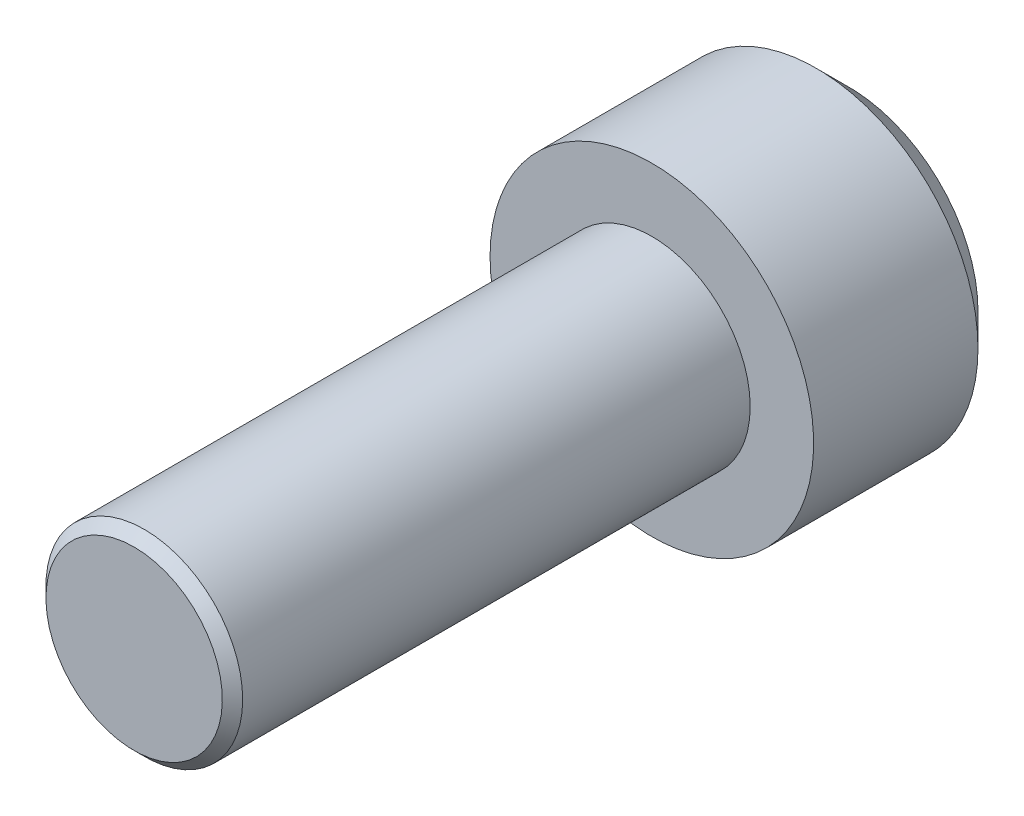
ISO-10303-21;
HEADER;
FILE_DESCRIPTION(('STEP AP214'),'2;1');
FILE_NAME('part.step','',(''),(''),'','','');
FILE_SCHEMA(('AUTOMOTIVE_DESIGN { 1 0 10303 214 1 1 1 1 }'));
ENDSEC;
DATA;
#1=APPLICATION_CONTEXT('core data for automotive mechanical design processes');
#2=APPLICATION_PROTOCOL_DEFINITION('international standard','automotive_design',2000,#1);
#3=PRODUCT_CONTEXT('',#1,'mechanical');
#4=PRODUCT('Part','Part','',(#3));
#5=PRODUCT_RELATED_PRODUCT_CATEGORY('part','',(#4));
#6=PRODUCT_DEFINITION_FORMATION('','',#4);
#7=PRODUCT_DEFINITION_CONTEXT('part definition',#1,'design');
#8=PRODUCT_DEFINITION('design','',#6,#7);
#9=PRODUCT_DEFINITION_SHAPE('','',#8);
#10=(LENGTH_UNIT() NAMED_UNIT(*) SI_UNIT(.MILLI.,.METRE.));
#11=(NAMED_UNIT(*) PLANE_ANGLE_UNIT() SI_UNIT($,.RADIAN.));
#12=(NAMED_UNIT(*) SI_UNIT($,.STERADIAN.) SOLID_ANGLE_UNIT());
#13=UNCERTAINTY_MEASURE_WITH_UNIT(LENGTH_MEASURE(1.E-05),#10,'distance_accuracy_value','');
#14=(GEOMETRIC_REPRESENTATION_CONTEXT(3) GLOBAL_UNCERTAINTY_ASSIGNED_CONTEXT((#13)) GLOBAL_UNIT_ASSIGNED_CONTEXT((#10,
#11,#12)) REPRESENTATION_CONTEXT('',''));
#15=CARTESIAN_POINT('',(0.,0.,0.));
#16=DIRECTION('',(0.,0.,1.));
#17=DIRECTION('',(1.,0.,0.));
#18=AXIS2_PLACEMENT_3D('',#15,#16,#17);
#19=CARTESIAN_POINT('',(0.,0.,-2.54));
#20=DIRECTION('',(0.,0.,1.));
#21=DIRECTION('',(1.,0.,0.));
#22=AXIS2_PLACEMENT_3D('',#19,#20,#21);
#23=PLANE('',#22);
#24=DIRECTION('',(0.991496436705714,-0.13013383879634,0.));
#25=VECTOR('',#24,1.);
#26=CARTESIAN_POINT('',(-0.258234336361407,-1.9675007415878,-2.54));
#27=LINE('',#26,#25);
#28=CARTESIAN_POINT('',(0.877702746425102,-2.11659240520014,-2.54));
#29=VERTEX_POINT('',#28);
#30=CARTESIAN_POINT('',(-1.39417141914796,-1.81840907797563,-2.54));
#31=VERTEX_POINT('',#30);
#32=EDGE_CURVE('E127',#29,#31,#27,.F.);
#33=ORIENTED_EDGE('',*,*,#32,.T.);
#34=DIRECTION('',(0.383049008063238,-0.923728021347068,0.));
#35=VECTOR('',#34,1.);
#36=CARTESIAN_POINT('',(-1.8330227923606,-0.760112875375502,-2.54));
#37=LINE('',#36,#35);
#38=CARTESIAN_POINT('',(-2.27187416557302,0.29818332722464,-2.54));
#39=VERTEX_POINT('',#38);
#40=EDGE_CURVE('E131',#31,#39,#37,.F.);
#41=ORIENTED_EDGE('',*,*,#40,.T.);
#42=DIRECTION('',(-0.608447428642477,-0.793594182550728,0.));
#43=VECTOR('',#42,1.);
#44=CARTESIAN_POINT('',(-1.57478845599901,1.2073878662123,-2.54));
#45=LINE('',#44,#43);
#46=CARTESIAN_POINT('',(-0.877702746424921,2.11659240520014,-2.54));
#47=VERTEX_POINT('',#46);
#48=EDGE_CURVE('E135',#39,#47,#45,.F.);
#49=ORIENTED_EDGE('',*,*,#48,.T.);
#50=DIRECTION('',(-0.991496436705714,0.13013383879634,0.));
#51=VECTOR('',#50,1.);
#52=CARTESIAN_POINT('',(0.258234336361587,1.9675007415878,-2.54));
#53=LINE('',#52,#51);
#54=CARTESIAN_POINT('',(1.39417141914813,1.81840907797555,-2.54));
#55=VERTEX_POINT('',#54);
#56=EDGE_CURVE('E68',#47,#55,#53,.F.);
#57=ORIENTED_EDGE('',*,*,#56,.T.);
#58=DIRECTION('',(-0.383049008063237,0.923728021347068,0.));
#59=VECTOR('',#58,1.);
#60=CARTESIAN_POINT('',(1.8330227923606,0.760112875375502,-2.54));
#61=LINE('',#60,#59);
#62=CARTESIAN_POINT('',(2.27187416557317,-0.298183327224643,-2.54));
#63=VERTEX_POINT('',#62);
#64=EDGE_CURVE('E70',#55,#63,#61,.F.);
#65=ORIENTED_EDGE('',*,*,#64,.T.);
#66=DIRECTION('',(0.608447428642477,0.793594182550728,0.));
#67=VECTOR('',#66,1.);
#68=CARTESIAN_POINT('',(1.57478845599919,-1.20738786621229,-2.54));
#69=LINE('',#68,#67);
#70=EDGE_CURVE('E72',#63,#29,#69,.F.);
#71=ORIENTED_EDGE('',*,*,#70,.T.);
#72=EDGE_LOOP('',(#33,#41,#49,#57,#65,#71));
#73=FACE_BOUND('',#72,.T.);
#74=ADVANCED_FACE('F17',(#73),#23,.F.);
#75=CARTESIAN_POINT('',(1.57478845599919,-1.20738786621229,-3.683));
#76=DIRECTION('',(0.793594182550728,-0.608447428642477,0.));
#77=DIRECTION('',(0.608447428642477,0.793594182550728,0.));
#78=AXIS2_PLACEMENT_3D('',#75,#76,#77);
#79=PLANE('',#78);
#80=DIRECTION('',(0.608447428642508,0.793594182550704,0.));
#81=VECTOR('',#80,1.);
#82=CARTESIAN_POINT('',(0.877702746425096,-2.11659240520014,-4.826));
#83=LINE('',#82,#81);
#84=CARTESIAN_POINT('',(0.877702746425106,-2.11659240520014,-4.826));
#85=VERTEX_POINT('',#84);
#86=CARTESIAN_POINT('',(2.27187416557315,-0.298183327224633,-4.826));
#87=VERTEX_POINT('',#86);
#88=EDGE_CURVE('E123',#85,#87,#83,.T.);
#89=ORIENTED_EDGE('',*,*,#88,.F.);
#90=DIRECTION('',(0.,0.,1.));
#91=VECTOR('',#90,1.);
#92=CARTESIAN_POINT('',(0.877702746425102,-2.1165924052001,-3.683));
#93=LINE('',#92,#91);
#94=EDGE_CURVE('E83',#85,#29,#93,.T.);
#95=ORIENTED_EDGE('',*,*,#94,.T.);
#96=ORIENTED_EDGE('',*,*,#70,.F.);
#97=DIRECTION('',(0.,0.,1.));
#98=VECTOR('',#97,1.);
#99=CARTESIAN_POINT('',(2.27187416557316,-0.298183327224662,-3.683));
#100=LINE('',#99,#98);
#101=EDGE_CURVE('E77',#63,#87,#100,.F.);
#102=ORIENTED_EDGE('',*,*,#101,.T.);
#103=EDGE_LOOP('',(#89,#95,#96,#102));
#104=FACE_BOUND('',#103,.T.);
#105=ADVANCED_FACE('F80',(#104),#79,.F.);
#106=CARTESIAN_POINT('',(1.8330227923606,0.760112875375502,-3.683));
#107=DIRECTION('',(0.923728021347068,0.383049008063237,0.));
#108=DIRECTION('',(-0.383049008063237,0.923728021347068,0.));
#109=AXIS2_PLACEMENT_3D('',#106,#107,#108);
#110=PLANE('',#109);
#111=DIRECTION('',(-0.383049008063222,0.923728021347075,0.));
#112=VECTOR('',#111,1.);
#113=CARTESIAN_POINT('',(2.27187416557319,-0.298183327224651,-4.826));
#114=LINE('',#113,#112);
#115=CARTESIAN_POINT('',(1.39417141914811,1.81840907797554,-4.826));
#116=VERTEX_POINT('',#115);
#117=EDGE_CURVE('E88',#87,#116,#114,.T.);
#118=ORIENTED_EDGE('',*,*,#117,.F.);
#119=ORIENTED_EDGE('',*,*,#101,.F.);
#120=ORIENTED_EDGE('',*,*,#64,.F.);
#121=DIRECTION('',(0.,0.,1.));
#122=VECTOR('',#121,1.);
#123=CARTESIAN_POINT('',(1.39417141914814,1.81840907797549,-3.683));
#124=LINE('',#123,#122);
#125=EDGE_CURVE('E91',#55,#116,#124,.F.);
#126=ORIENTED_EDGE('',*,*,#125,.T.);
#127=EDGE_LOOP('',(#118,#119,#120,#126));
#128=FACE_BOUND('',#127,.T.);
#129=ADVANCED_FACE('F86',(#128),#110,.F.);
#130=CARTESIAN_POINT('',(0.258234336361587,1.9675007415878,-3.683));
#131=DIRECTION('',(0.13013383879634,0.991496436705714,0.));
#132=DIRECTION('',(-0.991496436705714,0.13013383879634,0.));
#133=AXIS2_PLACEMENT_3D('',#130,#131,#132);
#134=PLANE('',#133);
#135=DIRECTION('',(-0.991496436705716,0.130133838796325,0.));
#136=VECTOR('',#135,1.);
#137=CARTESIAN_POINT('',(1.39417141914815,1.81840907797558,-4.826));
#138=LINE('',#137,#136);
#139=CARTESIAN_POINT('',(-0.877702746424923,2.11659240520013,-4.826));
#140=VERTEX_POINT('',#139);
#141=EDGE_CURVE('E119',#116,#140,#138,.T.);
#142=ORIENTED_EDGE('',*,*,#141,.F.);
#143=ORIENTED_EDGE('',*,*,#125,.F.);
#144=ORIENTED_EDGE('',*,*,#56,.F.);
#145=DIRECTION('',(0.,0.,1.));
#146=VECTOR('',#145,1.);
#147=CARTESIAN_POINT('',(-0.877702746424932,2.11659240520016,-3.683));
#148=LINE('',#147,#146);
#149=EDGE_CURVE('E133',#47,#140,#148,.F.);
#150=ORIENTED_EDGE('',*,*,#149,.T.);
#151=EDGE_LOOP('',(#142,#143,#144,#150));
#152=FACE_BOUND('',#151,.T.);
#153=ADVANCED_FACE('F138',(#152),#134,.F.);
#154=CARTESIAN_POINT('',(-1.57478845599901,1.2073878662123,-3.683));
#155=DIRECTION('',(-0.793594182550728,0.608447428642477,0.));
#156=DIRECTION('',(-0.608447428642477,-0.793594182550728,0.));
#157=AXIS2_PLACEMENT_3D('',#154,#155,#156);
#158=PLANE('',#157);
#159=DIRECTION('',(-0.608447428642506,-0.793594182550706,0.));
#160=VECTOR('',#159,1.);
#161=CARTESIAN_POINT('',(-0.877702746424916,2.11659240520015,-4.826));
#162=LINE('',#161,#160);
#163=CARTESIAN_POINT('',(-2.271874165573,0.298183327224631,-4.826));
#164=VERTEX_POINT('',#163);
#165=EDGE_CURVE('E116',#140,#164,#162,.T.);
#166=ORIENTED_EDGE('',*,*,#165,.F.);
#167=ORIENTED_EDGE('',*,*,#149,.F.);
#168=ORIENTED_EDGE('',*,*,#48,.F.);
#169=DIRECTION('',(0.,0.,1.));
#170=VECTOR('',#169,1.);
#171=CARTESIAN_POINT('',(-2.27187416557314,0.298183327224605,-3.683));
#172=LINE('',#171,#170);
#173=EDGE_CURVE('E129',#39,#164,#172,.F.);
#174=ORIENTED_EDGE('',*,*,#173,.T.);
#175=EDGE_LOOP('',(#166,#167,#168,#174));
#176=FACE_BOUND('',#175,.T.);
#177=ADVANCED_FACE('F150',(#176),#158,.F.);
#178=CARTESIAN_POINT('',(-1.8330227923606,-0.760112875375502,-3.683));
#179=DIRECTION('',(-0.923728021347068,-0.383049008063238,0.));
#180=DIRECTION('',(0.383049008063238,-0.923728021347068,0.));
#181=AXIS2_PLACEMENT_3D('',#178,#179,#180);
#182=PLANE('',#181);
#183=DIRECTION('',(0.383049008063206,-0.923728021347081,0.));
#184=VECTOR('',#183,1.);
#185=CARTESIAN_POINT('',(-2.27187416557299,0.298183327224665,-4.826));
#186=LINE('',#185,#184);
#187=CARTESIAN_POINT('',(-1.39417141914798,-1.81840907797564,-4.826));
#188=VERTEX_POINT('',#187);
#189=EDGE_CURVE('E113',#164,#188,#186,.T.);
#190=ORIENTED_EDGE('',*,*,#189,.F.);
#191=ORIENTED_EDGE('',*,*,#173,.F.);
#192=ORIENTED_EDGE('',*,*,#40,.F.);
#193=DIRECTION('',(0.,0.,1.));
#194=VECTOR('',#193,1.);
#195=CARTESIAN_POINT('',(-1.39417141914793,-1.8184090779755,-3.683));
#196=LINE('',#195,#194);
#197=EDGE_CURVE('E35',#31,#188,#196,.F.);
#198=ORIENTED_EDGE('',*,*,#197,.T.);
#199=EDGE_LOOP('',(#190,#191,#192,#198));
#200=FACE_BOUND('',#199,.T.);
#201=ADVANCED_FACE('F148',(#200),#182,.F.);
#202=CARTESIAN_POINT('',(-0.258234336361407,-1.9675007415878,-3.683));
#203=DIRECTION('',(-0.13013383879634,-0.991496436705714,0.));
#204=DIRECTION('',(0.991496436705714,-0.13013383879634,0.));
#205=AXIS2_PLACEMENT_3D('',#202,#203,#204);
#206=PLANE('',#205);
#207=DIRECTION('',(0.991496436705721,-0.130133838796284,0.));
#208=VECTOR('',#207,1.);
#209=CARTESIAN_POINT('',(-1.39417141914795,-1.81840907797567,-4.826));
#210=LINE('',#209,#208);
#211=EDGE_CURVE('E109',#188,#85,#210,.T.);
#212=ORIENTED_EDGE('',*,*,#211,.F.);
#213=ORIENTED_EDGE('',*,*,#197,.F.);
#214=ORIENTED_EDGE('',*,*,#32,.F.);
#215=ORIENTED_EDGE('',*,*,#94,.F.);
#216=EDGE_LOOP('',(#212,#213,#214,#215));
#217=FACE_BOUND('',#216,.T.);
#218=ADVANCED_FACE('F145',(#217),#206,.F.);
#219=CARTESIAN_POINT('',(0.,0.,-4.826));
#220=DIRECTION('',(0.,0.,-1.));
#221=DIRECTION('',(-1.,0.,0.));
#222=AXIS2_PLACEMENT_3D('',#219,#220,#221);
#223=PLANE('',#222);
#224=ORIENTED_EDGE('',*,*,#189,.T.);
#225=ORIENTED_EDGE('',*,*,#211,.T.);
#226=ORIENTED_EDGE('',*,*,#88,.T.);
#227=ORIENTED_EDGE('',*,*,#117,.T.);
#228=ORIENTED_EDGE('',*,*,#141,.T.);
#229=ORIENTED_EDGE('',*,*,#165,.T.);
#230=EDGE_LOOP('',(#224,#225,#226,#227,#228,#229));
#231=FACE_BOUND('',#230,.T.);
#232=CARTESIAN_POINT('',(0.,0.,-4.82600000071897));
#233=DIRECTION('',(0.,0.,1.));
#234=DIRECTION('',(1.,0.,0.));
#235=AXIS2_PLACEMENT_3D('',#232,#233,#234);
#236=CIRCLE('',#235,3.17500000073778);
#237=CARTESIAN_POINT('',(3.17500000073778,0.,-4.82600000071898));
#238=VERTEX_POINT('',#237);
#239=EDGE_CURVE('E20',#238,#238,#236,.T.);
#240=ORIENTED_EDGE('',*,*,#239,.F.);
#241=EDGE_LOOP('',(#240));
#242=FACE_BOUND('',#241,.T.);
#243=ADVANCED_FACE('F142',(#231,#242),#223,.T.);
#244=CARTESIAN_POINT('',(0.,0.,-4.03225000002294));
#245=DIRECTION('',(0.,0.,1.));
#246=DIRECTION('',(1.,0.,0.));
#247=AXIS2_PLACEMENT_3D('',#244,#245,#246);
#248=CONICAL_SURFACE('',#247,3.96875000001273,0.785398162502276);
#249=CARTESIAN_POINT('',(0.,0.,-4.03225));
#250=DIRECTION('',(0.,0.,-1.));
#251=DIRECTION('',(-1.,0.,0.));
#252=AXIS2_PLACEMENT_3D('',#249,#250,#251);
#253=CIRCLE('',#252,3.96875);
#254=CARTESIAN_POINT('',(-3.96875,0.,-4.03225));
#255=VERTEX_POINT('',#254);
#256=EDGE_CURVE('E101',#255,#255,#253,.F.);
#257=ORIENTED_EDGE('',*,*,#256,.F.);
#258=EDGE_LOOP('',(#257));
#259=FACE_BOUND('',#258,.T.);
#260=ORIENTED_EDGE('',*,*,#239,.T.);
#261=EDGE_LOOP('',(#260));
#262=FACE_BOUND('',#261,.T.);
#263=ADVANCED_FACE('F182',(#259,#262),#248,.T.);
#264=CARTESIAN_POINT('',(0.,0.,0.));
#265=DIRECTION('',(0.,0.,-1.));
#266=DIRECTION('',(-1.,0.,0.));
#267=AXIS2_PLACEMENT_3D('',#264,#265,#266);
#268=CYLINDRICAL_SURFACE('',#267,3.96875);
#269=ORIENTED_EDGE('',*,*,#256,.T.);
#270=EDGE_LOOP('',(#269));
#271=FACE_BOUND('',#270,.T.);
#272=CARTESIAN_POINT('',(0.,0.,0.));
#273=DIRECTION('',(0.,0.,-1.));
#274=DIRECTION('',(-1.,0.,0.));
#275=AXIS2_PLACEMENT_3D('',#272,#273,#274);
#276=CIRCLE('',#275,3.96875);
#277=CARTESIAN_POINT('',(-3.96875,0.,0.));
#278=VERTEX_POINT('',#277);
#279=EDGE_CURVE('E99',#278,#278,#276,.F.);
#280=ORIENTED_EDGE('',*,*,#279,.F.);
#281=EDGE_LOOP('',(#280));
#282=FACE_BOUND('',#281,.T.);
#283=ADVANCED_FACE('F178',(#271,#282),#268,.T.);
#284=CARTESIAN_POINT('',(0.,0.,12.7));
#285=DIRECTION('',(0.,0.,1.));
#286=DIRECTION('',(1.,0.,0.));
#287=AXIS2_PLACEMENT_3D('',#284,#285,#286);
#288=PLANE('',#287);
#289=CARTESIAN_POINT('',(0.,0.,12.6999999999384));
#290=DIRECTION('',(0.,0.,-1.));
#291=DIRECTION('',(0.,1.,0.));
#292=AXIS2_PLACEMENT_3D('',#289,#290,#291);
#293=CIRCLE('',#292,2.16299999999592);
#294=CARTESIAN_POINT('',(0.,2.16299999999592,12.6999999999384));
#295=VERTEX_POINT('',#294);
#296=EDGE_CURVE('E97',#295,#295,#293,.T.);
#297=ORIENTED_EDGE('',*,*,#296,.F.);
#298=EDGE_LOOP('',(#297));
#299=FACE_BOUND('',#298,.T.);
#300=ADVANCED_FACE('F175',(#299),#288,.T.);
#301=CARTESIAN_POINT('',(0.,0.,0.));
#302=DIRECTION('',(0.,0.,1.));
#303=DIRECTION('',(1.,0.,0.));
#304=AXIS2_PLACEMENT_3D('',#301,#302,#303);
#305=PLANE('',#304);
#306=ORIENTED_EDGE('',*,*,#279,.T.);
#307=EDGE_LOOP('',(#306));
#308=FACE_BOUND('',#307,.T.);
#309=CARTESIAN_POINT('',(0.,0.,0.));
#310=DIRECTION('',(0.,0.,1.));
#311=DIRECTION('',(1.,0.,0.));
#312=AXIS2_PLACEMENT_3D('',#309,#310,#311);
#313=CIRCLE('',#312,2.413);
#314=CARTESIAN_POINT('',(2.413,0.,0.));
#315=VERTEX_POINT('',#314);
#316=EDGE_CURVE('E26',#315,#315,#313,.T.);
#317=ORIENTED_EDGE('',*,*,#316,.F.);
#318=EDGE_LOOP('',(#317));
#319=FACE_BOUND('',#318,.T.);
#320=ADVANCED_FACE('F168',(#308,#319),#305,.T.);
#321=CARTESIAN_POINT('',(0.,0.,12.4499999998875));
#322=DIRECTION('',(0.,0.,-1.));
#323=DIRECTION('',(0.,1.,0.));
#324=AXIS2_PLACEMENT_3D('',#321,#322,#323);
#325=CONICAL_SURFACE('',#324,2.41300000010369,0.785398163511135);
#326=CARTESIAN_POINT('',(0.,0.,12.45));
#327=DIRECTION('',(0.,0.,1.));
#328=DIRECTION('',(1.,0.,0.));
#329=AXIS2_PLACEMENT_3D('',#326,#327,#328);
#330=CIRCLE('',#329,2.413);
#331=CARTESIAN_POINT('',(2.413,0.,12.45));
#332=VERTEX_POINT('',#331);
#333=EDGE_CURVE('E11',#332,#332,#330,.F.);
#334=ORIENTED_EDGE('',*,*,#333,.F.);
#335=EDGE_LOOP('',(#334));
#336=FACE_BOUND('',#335,.T.);
#337=ORIENTED_EDGE('',*,*,#296,.T.);
#338=EDGE_LOOP('',(#337));
#339=FACE_BOUND('',#338,.T.);
#340=ADVANCED_FACE('F162',(#336,#339),#325,.T.);
#341=CARTESIAN_POINT('',(0.,0.,0.));
#342=DIRECTION('',(0.,0.,1.));
#343=DIRECTION('',(1.,0.,0.));
#344=AXIS2_PLACEMENT_3D('',#341,#342,#343);
#345=CYLINDRICAL_SURFACE('',#344,2.413);
#346=ORIENTED_EDGE('',*,*,#333,.T.);
#347=EDGE_LOOP('',(#346));
#348=FACE_BOUND('',#347,.T.);
#349=ORIENTED_EDGE('',*,*,#316,.T.);
#350=EDGE_LOOP('',(#349));
#351=FACE_BOUND('',#350,.T.);
#352=ADVANCED_FACE('F160',(#348,#351),#345,.T.);
#353=CLOSED_SHELL('',(#74,#105,#129,#153,#177,#201,#218,#243,#263,#283,#300,#320,#340,#352));
#354=MANIFOLD_SOLID_BREP('B1',#353);
#355=ADVANCED_BREP_SHAPE_REPRESENTATION('',(#18,#354),#14);
#356=SHAPE_DEFINITION_REPRESENTATION(#9,#355);
ENDSEC;
END-ISO-10303-21;
